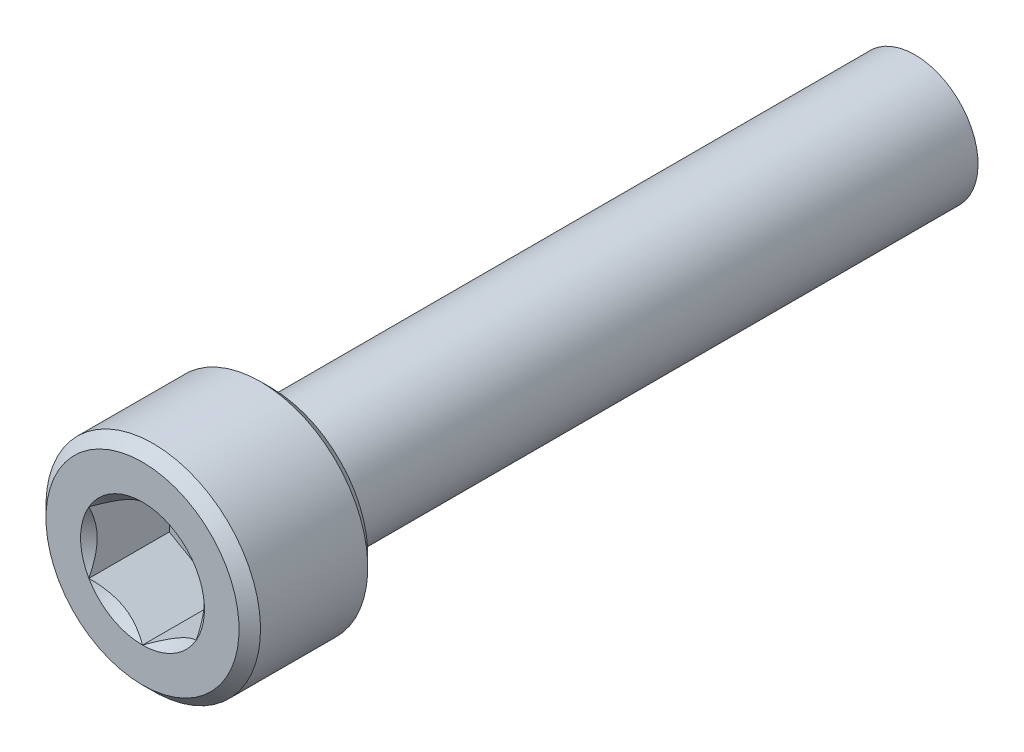
ISO-10303-21;
HEADER;
FILE_DESCRIPTION(('STEP AP214'),'2;1');
FILE_NAME('part.step','',(''),(''),'','','');
FILE_SCHEMA(('AUTOMOTIVE_DESIGN { 1 0 10303 214 1 1 1 1 }'));
ENDSEC;
DATA;
#1=APPLICATION_CONTEXT('core data for automotive mechanical design processes');
#2=APPLICATION_PROTOCOL_DEFINITION('international standard','automotive_design',2000,#1);
#3=PRODUCT_CONTEXT('',#1,'mechanical');
#4=PRODUCT('Part','Part','',(#3));
#5=PRODUCT_RELATED_PRODUCT_CATEGORY('part','',(#4));
#6=PRODUCT_DEFINITION_FORMATION('','',#4);
#7=PRODUCT_DEFINITION_CONTEXT('part definition',#1,'design');
#8=PRODUCT_DEFINITION('design','',#6,#7);
#9=PRODUCT_DEFINITION_SHAPE('','',#8);
#10=(LENGTH_UNIT() NAMED_UNIT(*) SI_UNIT(.MILLI.,.METRE.));
#11=(NAMED_UNIT(*) PLANE_ANGLE_UNIT() SI_UNIT($,.RADIAN.));
#12=(NAMED_UNIT(*) SI_UNIT($,.STERADIAN.) SOLID_ANGLE_UNIT());
#13=UNCERTAINTY_MEASURE_WITH_UNIT(LENGTH_MEASURE(1.E-05),#10,'distance_accuracy_value','');
#14=(GEOMETRIC_REPRESENTATION_CONTEXT(3) GLOBAL_UNCERTAINTY_ASSIGNED_CONTEXT((#13)) GLOBAL_UNIT_ASSIGNED_CONTEXT((#10,
#11,#12)) REPRESENTATION_CONTEXT('',''));
#15=CARTESIAN_POINT('',(0.,0.,0.));
#16=DIRECTION('',(0.,0.,1.));
#17=DIRECTION('',(1.,0.,0.));
#18=AXIS2_PLACEMENT_3D('',#15,#16,#17);
#19=CARTESIAN_POINT('',(2.5,-4.33012701892219,2.25));
#20=DIRECTION('',(0.,0.,1.));
#21=DIRECTION('',(0.,-1.,0.));
#22=AXIS2_PLACEMENT_3D('',#19,#20,#21);
#23=PLANE('',#22);
#24=DIRECTION('',(-0.866025403784439,-0.5,0.));
#25=VECTOR('',#24,1.);
#26=CARTESIAN_POINT('',(0.,2.88675134594813,2.25));
#27=LINE('',#26,#25);
#28=CARTESIAN_POINT('',(0.,2.88675134594813,2.25));
#29=VERTEX_POINT('',#28);
#30=CARTESIAN_POINT('',(-2.5,1.44337567297407,2.25));
#31=VERTEX_POINT('',#30);
#32=EDGE_CURVE('E82',#29,#31,#27,.T.);
#33=ORIENTED_EDGE('',*,*,#32,.T.);
#34=DIRECTION('',(0.,-1.,0.));
#35=VECTOR('',#34,1.);
#36=CARTESIAN_POINT('',(-2.5,1.44337567297407,2.25));
#37=LINE('',#36,#35);
#38=CARTESIAN_POINT('',(-2.5,-1.44337567297406,2.25));
#39=VERTEX_POINT('',#38);
#40=EDGE_CURVE('E84',#31,#39,#37,.T.);
#41=ORIENTED_EDGE('',*,*,#40,.T.);
#42=DIRECTION('',(0.866025403784439,-0.5,0.));
#43=VECTOR('',#42,1.);
#44=CARTESIAN_POINT('',(-2.5,-1.44337567297406,2.25));
#45=LINE('',#44,#43);
#46=CARTESIAN_POINT('',(0.,-2.88675134594813,2.25));
#47=VERTEX_POINT('',#46);
#48=EDGE_CURVE('E85',#39,#47,#45,.T.);
#49=ORIENTED_EDGE('',*,*,#48,.T.);
#50=DIRECTION('',(0.866025403784439,0.5,0.));
#51=VECTOR('',#50,1.);
#52=CARTESIAN_POINT('',(0.,-2.88675134594813,2.25));
#53=LINE('',#52,#51);
#54=CARTESIAN_POINT('',(2.5,-1.44337567297406,2.25));
#55=VERTEX_POINT('',#54);
#56=EDGE_CURVE('E71',#47,#55,#53,.T.);
#57=ORIENTED_EDGE('',*,*,#56,.T.);
#58=DIRECTION('',(0.,1.,0.));
#59=VECTOR('',#58,1.);
#60=CARTESIAN_POINT('',(2.5,-1.44337567297406,2.25));
#61=LINE('',#60,#59);
#62=CARTESIAN_POINT('',(2.5,1.44337567297407,2.25));
#63=VERTEX_POINT('',#62);
#64=EDGE_CURVE('E110',#55,#63,#61,.T.);
#65=ORIENTED_EDGE('',*,*,#64,.T.);
#66=DIRECTION('',(-0.866025403784439,0.5,0.));
#67=VECTOR('',#66,1.);
#68=CARTESIAN_POINT('',(2.5,1.44337567297407,2.25));
#69=LINE('',#68,#67);
#70=EDGE_CURVE('E115',#63,#29,#69,.T.);
#71=ORIENTED_EDGE('',*,*,#70,.T.);
#72=EDGE_LOOP('',(#33,#41,#49,#57,#65,#71));
#73=FACE_BOUND('',#72,.T.);
#74=ADVANCED_FACE('F16',(#73),#23,.T.);
#75=CARTESIAN_POINT('',(-2.5,-1.44337567297406,2.25));
#76=DIRECTION('',(-0.5,-0.866025403784439,0.));
#77=DIRECTION('',(0.866025403784439,-0.5,0.));
#78=AXIS2_PLACEMENT_3D('',#75,#76,#77);
#79=PLANE('',#78);
#80=CARTESIAN_POINT('',(-2.50000000000478,-1.44337567296488,5.99999999997284));
#81=CARTESIAN_POINT('',(-2.41407377906344,-1.49298519975992,5.95043808245741));
#82=CARTESIAN_POINT('',(-2.32671086994276,-1.54342419885962,5.90378750042485));
#83=CARTESIAN_POINT('',(-2.14856893286567,-1.64627449418629,5.8183722762495));
#84=CARTESIAN_POINT('',(-2.05777297285882,-1.69869556613711,5.77965514357985));
#85=CARTESIAN_POINT('',(-1.87468737313266,-1.80440008642343,5.71333243481046));
#86=CARTESIAN_POINT('',(-1.78244433466394,-1.85765662951433,5.68556020407587));
#87=CARTESIAN_POINT('',(-1.59592809138011,-1.96534183278258,5.64277179301007));
#88=CARTESIAN_POINT('',(-1.50166058027178,-2.01976720569677,5.62772368472119));
#89=CARTESIAN_POINT('',(-1.33918618210886,-2.11357184321254,5.61414605045882));
#90=CARTESIAN_POINT('',(-1.27118904996239,-2.15283000576143,5.61213672815934));
#91=CARTESIAN_POINT('',(-1.13530603995205,-2.2312820981692,5.61552620020698));
#92=CARTESIAN_POINT('',(-1.06742020943239,-2.27047600069389,5.620927591165));
#93=CARTESIAN_POINT('',(-0.932289663227805,-2.34849365792084,5.63883111085846));
#94=CARTESIAN_POINT('',(-0.865045749955355,-2.38731694935006,5.65134117856481));
#95=CARTESIAN_POINT('',(-0.731720772442206,-2.46429216100698,5.68277536815797));
#96=CARTESIAN_POINT('',(-0.66563961942911,-2.50244413248745,5.70169899813869));
#97=CARTESIAN_POINT('',(-0.496416901917538,-2.60014491399575,5.75786430114282));
#98=CARTESIAN_POINT('',(-0.394323538956246,-2.65908854458393,5.79933497180169));
#99=CARTESIAN_POINT('',(-0.244203096422894,-2.74576062249143,5.86934112808069));
#100=CARTESIAN_POINT('',(-0.194731548971638,-2.77432303372964,5.89393775594674));
#101=CARTESIAN_POINT('',(-0.0967044691439402,-2.83091899465603,5.94537285125215));
#102=CARTESIAN_POINT('',(-0.0481483974394195,-2.85895285572543,5.9722099447588));
#103=CARTESIAN_POINT('',(8.22878246257458E-12,-2.88675134595287,5.99999999997017));
#104=B_SPLINE_CURVE_WITH_KNOTS('',3,(#80,#81,#82,#83,#84,#85,#86,#87,#88,#89,#90,#91,#92,#93,
#94,#95,#96,#97,#98,#99,#100,#101,#102,#103),.UNSPECIFIED.,.F.,.F.,(4,2,2,2,2,2,2,2,2,2,2,4),
(0.,0.332957366453414,0.667853853669039,0.997433317041697,1.32618330926339,1.56147590696143,
1.79685096897262,2.0324894159688,2.26810979410381,2.6422318258904,2.82878537250701,
3.01522534660843),.UNSPECIFIED.);
#105=CARTESIAN_POINT('',(-2.50000000000431,-1.44337567297655,5.9999999999704));
#106=VERTEX_POINT('',#105);
#107=CARTESIAN_POINT('',(-1.2122602004148E-12,-2.8867513459538,5.9999999999711));
#108=VERTEX_POINT('',#107);
#109=EDGE_CURVE('E19',#106,#108,#104,.T.);
#110=ORIENTED_EDGE('',*,*,#109,.T.);
#111=DIRECTION('',(0.,0.,1.));
#112=VECTOR('',#111,1.);
#113=CARTESIAN_POINT('',(0.,-2.88675134594813,2.25));
#114=LINE('',#113,#112);
#115=EDGE_CURVE('E90',#108,#47,#114,.F.);
#116=ORIENTED_EDGE('',*,*,#115,.T.);
#117=ORIENTED_EDGE('',*,*,#48,.F.);
#118=DIRECTION('',(0.,0.,1.));
#119=VECTOR('',#118,1.);
#120=CARTESIAN_POINT('',(-2.5,-1.44337567297406,2.25));
#121=LINE('',#120,#119);
#122=EDGE_CURVE('E58',#39,#106,#121,.T.);
#123=ORIENTED_EDGE('',*,*,#122,.T.);
#124=EDGE_LOOP('',(#110,#116,#117,#123));
#125=FACE_BOUND('',#124,.T.);
#126=ADVANCED_FACE('F89',(#125),#79,.F.);
#127=CARTESIAN_POINT('',(-2.5,1.44337567297407,2.25));
#128=DIRECTION('',(-1.,0.,0.));
#129=DIRECTION('',(0.,-1.,0.));
#130=AXIS2_PLACEMENT_3D('',#127,#128,#129);
#131=PLANE('',#130);
#132=CARTESIAN_POINT('',(-2.49999999999444,1.4433756729828,5.99999999997284));
#133=CARTESIAN_POINT('',(-2.499999999998,1.3441566194114,5.95043808245644));
#134=CARTESIAN_POINT('',(-2.49999999999946,1.24327862122713,5.90378750042239));
#135=CARTESIAN_POINT('',(-2.50000000000054,1.03757803060085,5.81837227624268));
#136=CARTESIAN_POINT('',(-2.50000000000014,0.932735886711096,5.77965514357014));
#137=CARTESIAN_POINT('',(-2.49999999999986,0.721326846162478,5.7133324347933));
#138=CARTESIAN_POINT('',(-2.49999999999996,0.614813759992766,5.68556020405418));
#139=CARTESIAN_POINT('',(-2.50000000000004,0.399443353479625,5.64277179297774));
#140=CARTESIAN_POINT('',(-2.50000000000001,0.290592607662495,5.62772368468276));
#141=CARTESIAN_POINT('',(-2.49999999999999,0.10298333265714,5.61414605040953));
#142=CARTESIAN_POINT('',(-2.5,0.0244670075745337,5.61213672810486));
#143=CARTESIAN_POINT('',(-2.5,-0.132437177211233,5.61552620014042));
#144=CARTESIAN_POINT('',(-2.5,-0.210824982246007,5.62092759109157));
#145=CARTESIAN_POINT('',(-2.5,-0.366860296671375,5.63883111077006));
#146=CARTESIAN_POINT('',(-2.5,-0.444506879515861,5.65134117846832));
#147=CARTESIAN_POINT('',(-2.5,-0.598457302802447,5.68277536804459));
#148=CARTESIAN_POINT('',(-2.5,-0.67476124575008,5.7016989980165));
#149=CARTESIAN_POINT('',(-2.5,-0.87016280881075,5.75786430101982));
#150=CARTESIAN_POINT('',(-2.5,-0.988050070042253,5.79933497169557));
#151=CARTESIAN_POINT('',(-2.5,-1.16139422593618,5.86934112800866));
#152=CARTESIAN_POINT('',(-2.5,-1.21851904843836,5.89393775588756));
#153=CARTESIAN_POINT('',(-2.5,-1.3317109703414,5.94537285122098));
#154=CARTESIAN_POINT('',(-2.5,-1.38777869250468,5.97220994474277));
#155=CARTESIAN_POINT('',(-2.5,-1.44337567298356,5.99999999997017));
#156=B_SPLINE_CURVE_WITH_KNOTS('',3,(#132,#133,#134,#135,#136,#137,#138,#139,#140,#141,#142,
#143,#144,#145,#146,#147,#148,#149,#150,#151,#152,#153,#154,#155),.UNSPECIFIED.,.F.,.F.,(4,2,2,
2,2,2,2,2,2,2,2,4),(0.,0.332957366421071,0.667853853604345,0.997433316945952,1.32618330913662,
1.56147590678967,1.79685096875581,2.03248941570688,2.26810979379679,2.64223182575469,
2.8287853724575,3.01522534664473),.UNSPECIFIED.);
#157=CARTESIAN_POINT('',(-2.50000000000431,1.44337567297656,5.9999999999704));
#158=VERTEX_POINT('',#157);
#159=EDGE_CURVE('E94',#158,#106,#156,.T.);
#160=ORIENTED_EDGE('',*,*,#159,.T.);
#161=ORIENTED_EDGE('',*,*,#122,.F.);
#162=ORIENTED_EDGE('',*,*,#40,.F.);
#163=DIRECTION('',(0.,0.,1.));
#164=VECTOR('',#163,1.);
#165=CARTESIAN_POINT('',(-2.5,1.44337567297407,2.25));
#166=LINE('',#165,#164);
#167=EDGE_CURVE('E96',#31,#158,#166,.T.);
#168=ORIENTED_EDGE('',*,*,#167,.T.);
#169=EDGE_LOOP('',(#160,#161,#162,#168));
#170=FACE_BOUND('',#169,.T.);
#171=ADVANCED_FACE('F92',(#170),#131,.F.);
#172=CARTESIAN_POINT('',(0.,2.88675134594813,2.25));
#173=DIRECTION('',(-0.5,0.866025403784439,0.));
#174=DIRECTION('',(-0.866025403784439,-0.5,0.));
#175=AXIS2_PLACEMENT_3D('',#172,#173,#174);
#176=PLANE('',#175);
#177=CARTESIAN_POINT('',(1.03437304235675E-11,2.88675134594768,5.99999999997284));
#178=CARTESIAN_POINT('',(-0.0859262209345602,2.8371418191588,5.95043808245742));
#179=CARTESIAN_POINT('',(-0.173289130056698,2.78670282006164,5.90378750042485));
#180=CARTESIAN_POINT('',(-0.351431067134871,2.68385252473684,5.81837227624951));
#181=CARTESIAN_POINT('',(-0.442227027141324,2.63143145278532,5.77965514357985));
#182=CARTESIAN_POINT('',(-0.6253126268672,2.52572693249852,5.71333243481047));
#183=CARTESIAN_POINT('',(-0.717555665336021,2.47247038940779,5.68556020407588));
#184=CARTESIAN_POINT('',(-0.904071908619929,2.36478518613968,5.64277179301007));
#185=CARTESIAN_POINT('',(-0.998339419728224,2.31035981322544,5.6277236847212));
#186=CARTESIAN_POINT('',(-1.16081381789113,2.21655517570964,5.61414605045883));
#187=CARTESIAN_POINT('',(-1.22881095003761,2.17729701316076,5.61213672815934));
#188=CARTESIAN_POINT('',(-1.36469396004795,2.09884492075299,5.61552620020698));
#189=CARTESIAN_POINT('',(-1.43257979056761,2.0596510182283,5.620927591165));
#190=CARTESIAN_POINT('',(-1.56771033677219,1.98163336100134,5.63883111085846));
#191=CARTESIAN_POINT('',(-1.63495425004464,1.94281006957213,5.65134117856481));
#192=CARTESIAN_POINT('',(-1.76827922755779,1.86583485791521,5.68277536815798));
#193=CARTESIAN_POINT('',(-1.83436038057089,1.82768288643474,5.7016989981387));
#194=CARTESIAN_POINT('',(-2.00358309808246,1.72998210492644,5.75786430114282));
#195=CARTESIAN_POINT('',(-2.10567646104375,1.67103847433826,5.79933497180169));
#196=CARTESIAN_POINT('',(-2.2557969035771,1.58436639643077,5.8693411280807));
#197=CARTESIAN_POINT('',(-2.30526845102836,1.55580398519256,5.89393775594674));
#198=CARTESIAN_POINT('',(-2.40329553085606,1.49920802426616,5.94537285125216));
#199=CARTESIAN_POINT('',(-2.45185160256058,1.47117416319677,5.9722099447588));
#200=CARTESIAN_POINT('',(-2.50000000000822,1.44337567296932,5.99999999997017));
#201=B_SPLINE_CURVE_WITH_KNOTS('',3,(#177,#178,#179,#180,#181,#182,#183,#184,#185,#186,#187,
#188,#189,#190,#191,#192,#193,#194,#195,#196,#197,#198,#199,#200),.UNSPECIFIED.,.F.,.F.,(4,2,2,
2,2,2,2,2,2,2,2,4),(0.,0.332957366453413,0.667853853669037,0.997433317041695,1.32618330926339,
1.56147590696143,1.79685096897261,2.0324894159688,2.26810979410381,2.6422318258904,
2.828785372507,3.01522534660842),.UNSPECIFIED.);
#202=CARTESIAN_POINT('',(0.,2.88675134595311,5.9999999999704));
#203=VERTEX_POINT('',#202);
#204=EDGE_CURVE('E197',#203,#158,#201,.T.);
#205=ORIENTED_EDGE('',*,*,#204,.T.);
#206=ORIENTED_EDGE('',*,*,#167,.F.);
#207=ORIENTED_EDGE('',*,*,#32,.F.);
#208=DIRECTION('',(0.,0.,1.));
#209=VECTOR('',#208,1.);
#210=CARTESIAN_POINT('',(0.,2.88675134594813,2.25));
#211=LINE('',#210,#209);
#212=EDGE_CURVE('E112',#29,#203,#211,.T.);
#213=ORIENTED_EDGE('',*,*,#212,.T.);
#214=EDGE_LOOP('',(#205,#206,#207,#213));
#215=FACE_BOUND('',#214,.T.);
#216=ADVANCED_FACE('F207',(#215),#176,.F.);
#217=CARTESIAN_POINT('',(2.5,1.44337567297407,2.25));
#218=DIRECTION('',(0.5,0.866025403784439,0.));
#219=DIRECTION('',(-0.866025403784439,0.5,0.));
#220=AXIS2_PLACEMENT_3D('',#217,#218,#219);
#221=PLANE('',#220);
#222=CARTESIAN_POINT('',(2.50000000000478,1.44337567296489,5.99999999997284));
#223=CARTESIAN_POINT('',(2.41407377906344,1.49298519975993,5.95043808245742));
#224=CARTESIAN_POINT('',(2.32671086994276,1.54342419885963,5.90378750042486));
#225=CARTESIAN_POINT('',(2.14856893286567,1.6462744941863,5.81837227624951));
#226=CARTESIAN_POINT('',(2.05777297285882,1.69869556613712,5.77965514357985));
#227=CARTESIAN_POINT('',(1.87468737313266,1.80440008642344,5.71333243481047));
#228=CARTESIAN_POINT('',(1.78244433466394,1.85765662951434,5.68556020407588));
#229=CARTESIAN_POINT('',(1.59592809138011,1.96534183278259,5.64277179301007));
#230=CARTESIAN_POINT('',(1.50166058027179,2.01976720569678,5.6277236847212));
#231=CARTESIAN_POINT('',(1.33918618210886,2.11357184321255,5.61414605045883));
#232=CARTESIAN_POINT('',(1.2711890499624,2.15283000576144,5.61213672815935));
#233=CARTESIAN_POINT('',(1.13530603995205,2.23128209816921,5.61552620020699));
#234=CARTESIAN_POINT('',(1.06742020943239,2.2704760006939,5.62092759116501));
#235=CARTESIAN_POINT('',(0.932289663227807,2.34849365792085,5.63883111085847));
#236=CARTESIAN_POINT('',(0.865045749955358,2.38731694935007,5.65134117856482));
#237=CARTESIAN_POINT('',(0.731720772442207,2.46429216100699,5.68277536815798));
#238=CARTESIAN_POINT('',(0.665639619429111,2.50244413248746,5.7016989981387));
#239=CARTESIAN_POINT('',(0.49641690191754,2.60014491399576,5.75786430114283));
#240=CARTESIAN_POINT('',(0.394323538956249,2.65908854458394,5.7993349718017));
#241=CARTESIAN_POINT('',(0.244203096422899,2.74576062249143,5.8693411280807));
#242=CARTESIAN_POINT('',(0.194731548971643,2.77432303372964,5.89393775594674));
#243=CARTESIAN_POINT('',(0.0967044691439463,2.83091899465604,5.94537285125216));
#244=CARTESIAN_POINT('',(0.048148397439426,2.85895285572543,5.9722099447588));
#245=CARTESIAN_POINT('',(-8.22208739684531E-12,2.88675134595288,5.99999999997018));
#246=B_SPLINE_CURVE_WITH_KNOTS('',3,(#222,#223,#224,#225,#226,#227,#228,#229,#230,#231,#232,
#233,#234,#235,#236,#237,#238,#239,#240,#241,#242,#243,#244,#245),.UNSPECIFIED.,.F.,.F.,(4,2,2,
2,2,2,2,2,2,2,2,4),(0.,0.332957366453411,0.667853853669034,0.997433317041691,1.32618330926338,
1.56147590696142,1.79685096897261,2.03248941596879,2.26810979410381,2.64223182589039,
2.828785372507,3.01522534660841),.UNSPECIFIED.);
#247=CARTESIAN_POINT('',(2.50000000000431,1.44337567297656,5.9999999999704));
#248=VERTEX_POINT('',#247);
#249=EDGE_CURVE('E189',#248,#203,#246,.T.);
#250=ORIENTED_EDGE('',*,*,#249,.T.);
#251=ORIENTED_EDGE('',*,*,#212,.F.);
#252=ORIENTED_EDGE('',*,*,#70,.F.);
#253=DIRECTION('',(0.,0.,-1.));
#254=VECTOR('',#253,1.);
#255=CARTESIAN_POINT('',(2.5,1.44337567297407,2.25));
#256=LINE('',#255,#254);
#257=EDGE_CURVE('E107',#63,#248,#256,.F.);
#258=ORIENTED_EDGE('',*,*,#257,.T.);
#259=EDGE_LOOP('',(#250,#251,#252,#258));
#260=FACE_BOUND('',#259,.T.);
#261=ADVANCED_FACE('F203',(#260),#221,.F.);
#262=CARTESIAN_POINT('',(2.5,-1.44337567297406,2.25));
#263=DIRECTION('',(1.,0.,0.));
#264=DIRECTION('',(0.,0.,-1.));
#265=AXIS2_PLACEMENT_3D('',#262,#263,#264);
#266=PLANE('',#265);
#267=CARTESIAN_POINT('',(2.49999999999444,-1.44337567298279,5.99999999997284));
#268=CARTESIAN_POINT('',(2.499999999998,-1.3441566194114,5.95043808245644));
#269=CARTESIAN_POINT('',(2.49999999999946,-1.24327862122713,5.90378750042239));
#270=CARTESIAN_POINT('',(2.50000000000054,-1.03757803060085,5.81837227624268));
#271=CARTESIAN_POINT('',(2.50000000000014,-0.932735886711091,5.77965514357014));
#272=CARTESIAN_POINT('',(2.49999999999986,-0.721326846162473,5.7133324347933));
#273=CARTESIAN_POINT('',(2.49999999999996,-0.614813759992762,5.68556020405418));
#274=CARTESIAN_POINT('',(2.50000000000004,-0.399443353479622,5.64277179297774));
#275=CARTESIAN_POINT('',(2.50000000000001,-0.290592607662492,5.62772368468276));
#276=CARTESIAN_POINT('',(2.49999999999999,-0.102983332657137,5.61414605040954));
#277=CARTESIAN_POINT('',(2.5,-0.0244670075745308,5.61213672810486));
#278=CARTESIAN_POINT('',(2.5,0.132437177211236,5.61552620014043));
#279=CARTESIAN_POINT('',(2.5,0.21082498224601,5.62092759109157));
#280=CARTESIAN_POINT('',(2.5,0.366860296671379,5.63883111077006));
#281=CARTESIAN_POINT('',(2.5,0.444506879515865,5.65134117846832));
#282=CARTESIAN_POINT('',(2.5,0.598457302802451,5.68277536804459));
#283=CARTESIAN_POINT('',(2.5,0.674761245750083,5.7016989980165));
#284=CARTESIAN_POINT('',(2.5,0.870162808810754,5.75786430101983));
#285=CARTESIAN_POINT('',(2.5,0.988050070042257,5.79933497169558));
#286=CARTESIAN_POINT('',(2.5,1.16139422593619,5.86934112800866));
#287=CARTESIAN_POINT('',(2.5,1.21851904843837,5.89393775588756));
#288=CARTESIAN_POINT('',(2.5,1.33171097034141,5.94537285122098));
#289=CARTESIAN_POINT('',(2.5,1.38777869250468,5.97220994474277));
#290=CARTESIAN_POINT('',(2.5,1.44337567298357,5.99999999997018));
#291=B_SPLINE_CURVE_WITH_KNOTS('',3,(#267,#268,#269,#270,#271,#272,#273,#274,#275,#276,#277,
#278,#279,#280,#281,#282,#283,#284,#285,#286,#287,#288,#289,#290),.UNSPECIFIED.,.F.,.F.,(4,2,2,
2,2,2,2,2,2,2,2,4),(0.,0.33295736642107,0.667853853604343,0.997433316945949,1.32618330913661,
1.56147590678967,1.79685096875581,2.03248941570687,2.26810979379679,2.64223182575469,
2.8287853724575,3.01522534664473),.UNSPECIFIED.);
#292=CARTESIAN_POINT('',(2.50000000000431,-1.44337567297655,5.9999999999704));
#293=VERTEX_POINT('',#292);
#294=EDGE_CURVE('E159',#293,#248,#291,.T.);
#295=ORIENTED_EDGE('',*,*,#294,.T.);
#296=ORIENTED_EDGE('',*,*,#257,.F.);
#297=ORIENTED_EDGE('',*,*,#64,.F.);
#298=DIRECTION('',(0.,0.,1.));
#299=VECTOR('',#298,1.);
#300=CARTESIAN_POINT('',(2.5,-1.44337567297406,2.25));
#301=LINE('',#300,#299);
#302=EDGE_CURVE('E39',#55,#293,#301,.T.);
#303=ORIENTED_EDGE('',*,*,#302,.T.);
#304=EDGE_LOOP('',(#295,#296,#297,#303));
#305=FACE_BOUND('',#304,.T.);
#306=ADVANCED_FACE('F206',(#305),#266,.F.);
#307=CARTESIAN_POINT('',(0.,-2.88675134594813,2.25));
#308=DIRECTION('',(0.5,-0.866025403784439,0.));
#309=DIRECTION('',(0.866025403784439,0.5,0.));
#310=AXIS2_PLACEMENT_3D('',#307,#308,#309);
#311=PLANE('',#310);
#312=CARTESIAN_POINT('',(-1.03421625670786E-11,-2.88675134594768,5.99999999997284));
#313=CARTESIAN_POINT('',(0.0859262209345617,-2.8371418191588,5.95043808245742));
#314=CARTESIAN_POINT('',(0.1732891300567,-2.78670282006164,5.90378750042485));
#315=CARTESIAN_POINT('',(0.351431067134872,-2.68385252473684,5.81837227624951));
#316=CARTESIAN_POINT('',(0.442227027141325,-2.63143145278532,5.77965514357985));
#317=CARTESIAN_POINT('',(0.625312626867201,-2.52572693249852,5.71333243481047));
#318=CARTESIAN_POINT('',(0.717555665336022,-2.47247038940779,5.68556020407588));
#319=CARTESIAN_POINT('',(0.904071908619929,-2.36478518613968,5.64277179301007));
#320=CARTESIAN_POINT('',(0.998339419728224,-2.31035981322543,5.6277236847212));
#321=CARTESIAN_POINT('',(1.16081381789113,-2.21655517570964,5.61414605045883));
#322=CARTESIAN_POINT('',(1.2288109500376,-2.17729701316076,5.61213672815935));
#323=CARTESIAN_POINT('',(1.36469396004795,-2.09884492075299,5.61552620020698));
#324=CARTESIAN_POINT('',(1.43257979056761,-2.0596510182283,5.62092759116501));
#325=CARTESIAN_POINT('',(1.56771033677219,-1.98163336100134,5.63883111085846));
#326=CARTESIAN_POINT('',(1.63495425004464,-1.94281006957213,5.65134117856481));
#327=CARTESIAN_POINT('',(1.76827922755779,-1.86583485791521,5.68277536815798));
#328=CARTESIAN_POINT('',(1.83436038057089,-1.82768288643474,5.7016989981387));
#329=CARTESIAN_POINT('',(2.00358309808246,-1.72998210492644,5.75786430114283));
#330=CARTESIAN_POINT('',(2.10567646104375,-1.67103847433826,5.7993349718017));
#331=CARTESIAN_POINT('',(2.25579690357711,-1.58436639643076,5.8693411280807));
#332=CARTESIAN_POINT('',(2.30526845102836,-1.55580398519255,5.89393775594674));
#333=CARTESIAN_POINT('',(2.40329553085606,-1.49920802426616,5.94537285125216));
#334=CARTESIAN_POINT('',(2.45185160256058,-1.47117416319676,5.9722099447588));
#335=CARTESIAN_POINT('',(2.50000000000823,-1.44337567296932,5.99999999997018));
#336=B_SPLINE_CURVE_WITH_KNOTS('',3,(#312,#313,#314,#315,#316,#317,#318,#319,#320,#321,#322,
#323,#324,#325,#326,#327,#328,#329,#330,#331,#332,#333,#334,#335),.UNSPECIFIED.,.F.,.F.,(4,2,2,
2,2,2,2,2,2,2,2,4),(0.,0.332957366453413,0.667853853669036,0.997433317041693,1.32618330926338,
1.56147590696143,1.79685096897261,2.0324894159688,2.26810979410381,2.6422318258904,
2.828785372507,3.01522534660842),.UNSPECIFIED.);
#337=EDGE_CURVE('E151',#108,#293,#336,.T.);
#338=ORIENTED_EDGE('',*,*,#337,.T.);
#339=ORIENTED_EDGE('',*,*,#302,.F.);
#340=ORIENTED_EDGE('',*,*,#56,.F.);
#341=ORIENTED_EDGE('',*,*,#115,.F.);
#342=EDGE_LOOP('',(#338,#339,#340,#341));
#343=FACE_BOUND('',#342,.T.);
#344=ADVANCED_FACE('F167',(#343),#311,.F.);
#345=CARTESIAN_POINT('',(0.,0.,5.99999999997181));
#346=DIRECTION('',(0.,0.,1.));
#347=DIRECTION('',(0.,-1.,0.));
#348=AXIS2_PLACEMENT_3D('',#345,#346,#347);
#349=CONICAL_SURFACE('',#348,2.88675134595451,0.785398163397448);
#350=ORIENTED_EDGE('',*,*,#109,.F.);
#351=CARTESIAN_POINT('',(0.,0.,5.99999999997181));
#352=DIRECTION('',(0.,0.,1.));
#353=DIRECTION('',(0.,-1.,0.));
#354=AXIS2_PLACEMENT_3D('',#351,#352,#353);
#355=CIRCLE('',#354,2.88675134595451);
#356=EDGE_CURVE('E148',#108,#106,#355,.F.);
#357=ORIENTED_EDGE('',*,*,#356,.F.);
#358=EDGE_LOOP('',(#350,#357));
#359=FACE_BOUND('',#358,.T.);
#360=ADVANCED_FACE('F224',(#359),#349,.F.);
#361=CARTESIAN_POINT('',(0.,0.,5.99999999997181));
#362=DIRECTION('',(0.,0.,1.));
#363=DIRECTION('',(0.,-1.,0.));
#364=AXIS2_PLACEMENT_3D('',#361,#362,#363);
#365=CONICAL_SURFACE('',#364,2.88675134595451,0.785398163324398);
#366=CARTESIAN_POINT('',(0.,0.,5.99999999997181));
#367=DIRECTION('',(0.,0.,1.));
#368=DIRECTION('',(0.,-1.,0.));
#369=AXIS2_PLACEMENT_3D('',#366,#367,#368);
#370=CIRCLE('',#369,2.88675134595451);
#371=EDGE_CURVE('E145',#106,#158,#370,.F.);
#372=ORIENTED_EDGE('',*,*,#371,.F.);
#373=ORIENTED_EDGE('',*,*,#159,.F.);
#374=EDGE_LOOP('',(#372,#373));
#375=FACE_BOUND('',#374,.T.);
#376=ADVANCED_FACE('F221',(#375),#365,.F.);
#377=CARTESIAN_POINT('',(0.,0.,5.99999999997181));
#378=DIRECTION('',(0.,0.,1.));
#379=DIRECTION('',(0.,-1.,0.));
#380=AXIS2_PLACEMENT_3D('',#377,#378,#379);
#381=CONICAL_SURFACE('',#380,2.88675134595451,0.785398163397448);
#382=ORIENTED_EDGE('',*,*,#204,.F.);
#383=CARTESIAN_POINT('',(0.,0.,5.99999999997181));
#384=DIRECTION('',(0.,0.,1.));
#385=DIRECTION('',(0.,-1.,0.));
#386=AXIS2_PLACEMENT_3D('',#383,#384,#385);
#387=CIRCLE('',#386,2.88675134595451);
#388=EDGE_CURVE('E142',#158,#203,#387,.F.);
#389=ORIENTED_EDGE('',*,*,#388,.F.);
#390=EDGE_LOOP('',(#382,#389));
#391=FACE_BOUND('',#390,.T.);
#392=ADVANCED_FACE('F185',(#391),#381,.F.);
#393=CARTESIAN_POINT('',(0.,0.,5.99999999997181));
#394=DIRECTION('',(0.,0.,1.));
#395=DIRECTION('',(0.,-1.,0.));
#396=AXIS2_PLACEMENT_3D('',#393,#394,#395);
#397=CONICAL_SURFACE('',#396,2.88675134595451,0.785398163397448);
#398=ORIENTED_EDGE('',*,*,#249,.F.);
#399=CARTESIAN_POINT('',(0.,0.,5.99999999997181));
#400=DIRECTION('',(0.,0.,1.));
#401=DIRECTION('',(0.,-1.,0.));
#402=AXIS2_PLACEMENT_3D('',#399,#400,#401);
#403=CIRCLE('',#402,2.88675134595451);
#404=EDGE_CURVE('E139',#203,#248,#403,.F.);
#405=ORIENTED_EDGE('',*,*,#404,.F.);
#406=EDGE_LOOP('',(#398,#405));
#407=FACE_BOUND('',#406,.T.);
#408=ADVANCED_FACE('F180',(#407),#397,.F.);
#409=CARTESIAN_POINT('',(0.,0.,5.99999999997181));
#410=DIRECTION('',(0.,0.,1.));
#411=DIRECTION('',(0.,-1.,0.));
#412=AXIS2_PLACEMENT_3D('',#409,#410,#411);
#413=CONICAL_SURFACE('',#412,2.88675134595451,0.785398163324398);
#414=ORIENTED_EDGE('',*,*,#294,.F.);
#415=CARTESIAN_POINT('',(0.,0.,5.99999999997181));
#416=DIRECTION('',(0.,0.,1.));
#417=DIRECTION('',(0.,-1.,0.));
#418=AXIS2_PLACEMENT_3D('',#415,#416,#417);
#419=CIRCLE('',#418,2.88675134595451);
#420=EDGE_CURVE('E136',#248,#293,#419,.F.);
#421=ORIENTED_EDGE('',*,*,#420,.F.);
#422=EDGE_LOOP('',(#414,#421));
#423=FACE_BOUND('',#422,.T.);
#424=ADVANCED_FACE('F174',(#423),#413,.F.);
#425=CARTESIAN_POINT('',(0.,0.,5.99999999997181));
#426=DIRECTION('',(0.,0.,1.));
#427=DIRECTION('',(0.,-1.,0.));
#428=AXIS2_PLACEMENT_3D('',#425,#426,#427);
#429=CONICAL_SURFACE('',#428,2.88675134595451,0.785398163397448);
#430=ORIENTED_EDGE('',*,*,#337,.F.);
#431=CARTESIAN_POINT('',(0.,0.,5.99999999997181));
#432=DIRECTION('',(0.,0.,1.));
#433=DIRECTION('',(0.,-1.,0.));
#434=AXIS2_PLACEMENT_3D('',#431,#432,#433);
#435=CIRCLE('',#434,2.88675134595451);
#436=EDGE_CURVE('E133',#293,#108,#435,.F.);
#437=ORIENTED_EDGE('',*,*,#436,.F.);
#438=EDGE_LOOP('',(#430,#437));
#439=FACE_BOUND('',#438,.T.);
#440=ADVANCED_FACE('F169',(#439),#429,.F.);
#441=CARTESIAN_POINT('',(0.,0.,6.));
#442=DIRECTION('',(0.,0.,1.));
#443=DIRECTION('',(0.,-1.,0.));
#444=AXIS2_PLACEMENT_3D('',#441,#442,#443);
#445=PLANE('',#444);
#446=ORIENTED_EDGE('',*,*,#420,.T.);
#447=ORIENTED_EDGE('',*,*,#436,.T.);
#448=ORIENTED_EDGE('',*,*,#356,.T.);
#449=ORIENTED_EDGE('',*,*,#371,.T.);
#450=ORIENTED_EDGE('',*,*,#388,.T.);
#451=ORIENTED_EDGE('',*,*,#404,.T.);
#452=EDGE_LOOP('',(#446,#447,#448,#449,#450,#451));
#453=FACE_BOUND('',#452,.T.);
#454=CARTESIAN_POINT('',(0.,0.,5.99999999997181));
#455=DIRECTION('',(0.,0.,-1.));
#456=DIRECTION('',(0.,1.,0.));
#457=AXIS2_PLACEMENT_3D('',#454,#455,#456);
#458=CIRCLE('',#457,4.50000000000728);
#459=CARTESIAN_POINT('',(0.,4.50000000000728,5.99999999997181));
#460=VERTEX_POINT('',#459);
#461=EDGE_CURVE('E129',#460,#460,#458,.T.);
#462=ORIENTED_EDGE('',*,*,#461,.F.);
#463=EDGE_LOOP('',(#462));
#464=FACE_BOUND('',#463,.T.);
#465=ADVANCED_FACE('F173',(#453,#464),#445,.T.);
#466=CARTESIAN_POINT('',(0.,0.,5.50000000004047));
#467=DIRECTION('',(0.,0.,-1.));
#468=DIRECTION('',(0.,1.,0.));
#469=AXIS2_PLACEMENT_3D('',#466,#467,#468);
#470=CONICAL_SURFACE('',#469,4.99999999993861,0.785398163397448);
#471=ORIENTED_EDGE('',*,*,#461,.T.);
#472=EDGE_LOOP('',(#471));
#473=FACE_BOUND('',#472,.T.);
#474=CARTESIAN_POINT('',(0.,0.,5.5));
#475=DIRECTION('',(0.,0.,-1.));
#476=DIRECTION('',(0.,1.,0.));
#477=AXIS2_PLACEMENT_3D('',#474,#475,#476);
#478=CIRCLE('',#477,5.);
#479=CARTESIAN_POINT('',(0.,5.,5.5));
#480=VERTEX_POINT('',#479);
#481=EDGE_CURVE('E132',#480,#480,#478,.T.);
#482=ORIENTED_EDGE('',*,*,#481,.F.);
#483=EDGE_LOOP('',(#482));
#484=FACE_BOUND('',#483,.T.);
#485=ADVANCED_FACE('F256',(#473,#484),#470,.T.);
#486=CARTESIAN_POINT('',(0.,0.,6.));
#487=DIRECTION('',(0.,0.,-1.));
#488=DIRECTION('',(0.,1.,0.));
#489=AXIS2_PLACEMENT_3D('',#486,#487,#488);
#490=CYLINDRICAL_SURFACE('',#489,5.);
#491=ORIENTED_EDGE('',*,*,#481,.T.);
#492=EDGE_LOOP('',(#491));
#493=FACE_BOUND('',#492,.T.);
#494=CARTESIAN_POINT('',(0.,0.,0.499999999988177));
#495=DIRECTION('',(0.,0.,1.));
#496=DIRECTION('',(-1.,0.,0.));
#497=AXIS2_PLACEMENT_3D('',#494,#495,#496);
#498=CIRCLE('',#497,4.99999999999545);
#499=CARTESIAN_POINT('',(-4.99999999999545,0.,0.499999999988177));
#500=VERTEX_POINT('',#499);
#501=EDGE_CURVE('E128',#500,#500,#498,.F.);
#502=ORIENTED_EDGE('',*,*,#501,.F.);
#503=EDGE_LOOP('',(#502));
#504=FACE_BOUND('',#503,.T.);
#505=ADVANCED_FACE('F253',(#493,#504),#490,.T.);
#506=CARTESIAN_POINT('',(0.,0.,0.49999999987449));
#507=DIRECTION('',(0.,0.,1.));
#508=DIRECTION('',(0.,-1.,0.));
#509=AXIS2_PLACEMENT_3D('',#506,#507,#508);
#510=CONICAL_SURFACE('',#509,4.99999999988177,0.785398163397448);
#511=CARTESIAN_POINT('',(0.,0.,0.));
#512=DIRECTION('',(0.,0.,1.));
#513=DIRECTION('',(0.,-1.,0.));
#514=AXIS2_PLACEMENT_3D('',#511,#512,#513);
#515=CIRCLE('',#514,4.50000000000728);
#516=CARTESIAN_POINT('',(0.,-4.50000000000728,0.));
#517=VERTEX_POINT('',#516);
#518=EDGE_CURVE('E125',#517,#517,#515,.T.);
#519=ORIENTED_EDGE('',*,*,#518,.T.);
#520=EDGE_LOOP('',(#519));
#521=FACE_BOUND('',#520,.T.);
#522=ORIENTED_EDGE('',*,*,#501,.T.);
#523=EDGE_LOOP('',(#522));
#524=FACE_BOUND('',#523,.T.);
#525=ADVANCED_FACE('F249',(#521,#524),#510,.T.);
#526=CARTESIAN_POINT('',(0.,0.,-30.));
#527=DIRECTION('',(0.,0.,-1.));
#528=DIRECTION('',(0.,1.,0.));
#529=AXIS2_PLACEMENT_3D('',#526,#527,#528);
#530=PLANE('',#529);
#531=CARTESIAN_POINT('',(0.,0.,-30.));
#532=DIRECTION('',(0.,0.,-1.));
#533=DIRECTION('',(0.,1.,0.));
#534=AXIS2_PLACEMENT_3D('',#531,#532,#533);
#535=CIRCLE('',#534,2.942);
#536=CARTESIAN_POINT('',(0.,2.942,-30.));
#537=VERTEX_POINT('',#536);
#538=EDGE_CURVE('E30',#537,#537,#535,.F.);
#539=ORIENTED_EDGE('',*,*,#538,.F.);
#540=EDGE_LOOP('',(#539));
#541=FACE_BOUND('',#540,.T.);
#542=ADVANCED_FACE('F242',(#541),#530,.T.);
#543=CARTESIAN_POINT('',(0.,0.,0.));
#544=DIRECTION('',(0.,0.,1.));
#545=DIRECTION('',(0.,-1.,0.));
#546=AXIS2_PLACEMENT_3D('',#543,#544,#545);
#547=PLANE('',#546);
#548=CARTESIAN_POINT('',(0.,0.,0.));
#549=DIRECTION('',(0.,0.,-1.));
#550=DIRECTION('',(0.,1.,0.));
#551=AXIS2_PLACEMENT_3D('',#548,#549,#550);
#552=CIRCLE('',#551,2.942);
#553=CARTESIAN_POINT('',(0.,2.942,0.));
#554=VERTEX_POINT('',#553);
#555=EDGE_CURVE('E11',#554,#554,#552,.T.);
#556=ORIENTED_EDGE('',*,*,#555,.F.);
#557=EDGE_LOOP('',(#556));
#558=FACE_BOUND('',#557,.T.);
#559=ORIENTED_EDGE('',*,*,#518,.F.);
#560=EDGE_LOOP('',(#559));
#561=FACE_BOUND('',#560,.T.);
#562=ADVANCED_FACE('F236',(#558,#561),#547,.F.);
#563=CARTESIAN_POINT('',(0.,0.,-30.));
#564=DIRECTION('',(0.,0.,-1.));
#565=DIRECTION('',(0.,1.,0.));
#566=AXIS2_PLACEMENT_3D('',#563,#564,#565);
#567=CYLINDRICAL_SURFACE('',#566,2.942);
#568=ORIENTED_EDGE('',*,*,#555,.T.);
#569=EDGE_LOOP('',(#568));
#570=FACE_BOUND('',#569,.T.);
#571=ORIENTED_EDGE('',*,*,#538,.T.);
#572=EDGE_LOOP('',(#571));
#573=FACE_BOUND('',#572,.T.);
#574=ADVANCED_FACE('F234',(#570,#573),#567,.T.);
#575=CLOSED_SHELL('',(#74,#126,#171,#216,#261,#306,#344,#360,#376,#392,#408,#424,#440,#465,#485,
#505,#525,#542,#562,#574));
#576=MANIFOLD_SOLID_BREP('B1',#575);
#577=ADVANCED_BREP_SHAPE_REPRESENTATION('',(#18,#576),#14);
#578=SHAPE_DEFINITION_REPRESENTATION(#9,#577);
ENDSEC;
END-ISO-10303-21;
